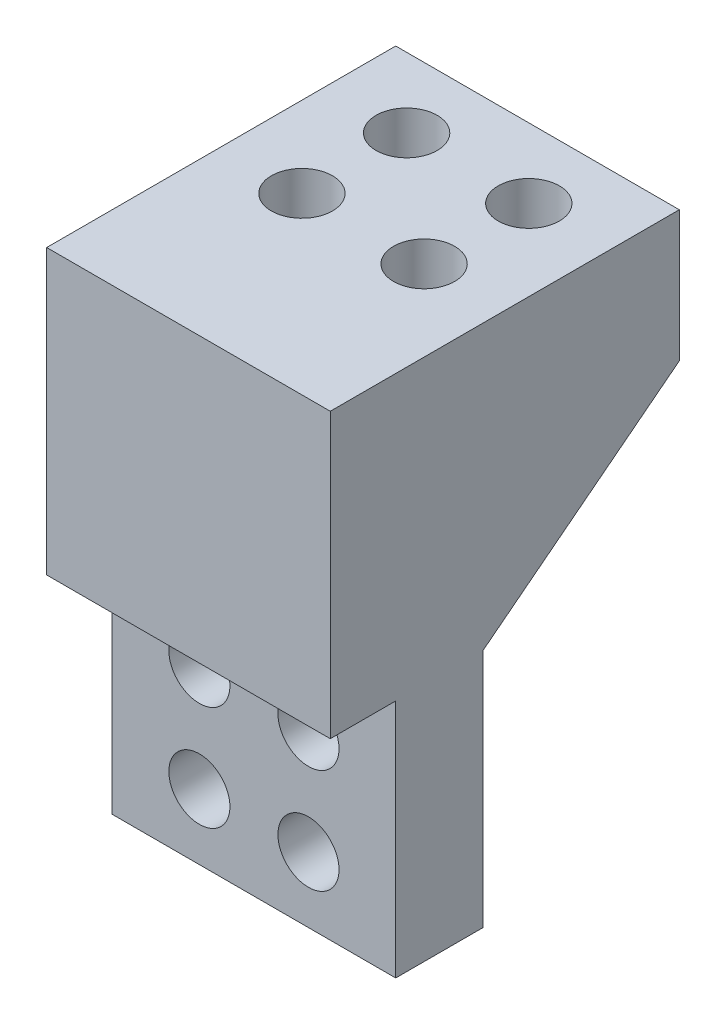
ISO-10303-21;
HEADER;
FILE_DESCRIPTION(('STEP AP214'),'2;1');
FILE_NAME('part.step','',(''),(''),'','','');
FILE_SCHEMA(('AUTOMOTIVE_DESIGN { 1 0 10303 214 1 1 1 1 }'));
ENDSEC;
DATA;
#1=APPLICATION_CONTEXT('core data for automotive mechanical design processes');
#2=APPLICATION_PROTOCOL_DEFINITION('international standard','automotive_design',2000,#1);
#3=PRODUCT_CONTEXT('',#1,'mechanical');
#4=PRODUCT('Part','Part','',(#3));
#5=PRODUCT_RELATED_PRODUCT_CATEGORY('part','',(#4));
#6=PRODUCT_DEFINITION_FORMATION('','',#4);
#7=PRODUCT_DEFINITION_CONTEXT('part definition',#1,'design');
#8=PRODUCT_DEFINITION('design','',#6,#7);
#9=PRODUCT_DEFINITION_SHAPE('','',#8);
#10=(LENGTH_UNIT() NAMED_UNIT(*) SI_UNIT(.MILLI.,.METRE.));
#11=(NAMED_UNIT(*) PLANE_ANGLE_UNIT() SI_UNIT($,.RADIAN.));
#12=(NAMED_UNIT(*) SI_UNIT($,.STERADIAN.) SOLID_ANGLE_UNIT());
#13=UNCERTAINTY_MEASURE_WITH_UNIT(LENGTH_MEASURE(1.E-05),#10,'distance_accuracy_value','');
#14=(GEOMETRIC_REPRESENTATION_CONTEXT(3) GLOBAL_UNCERTAINTY_ASSIGNED_CONTEXT((#13)) GLOBAL_UNIT_ASSIGNED_CONTEXT((#10,
#11,#12)) REPRESENTATION_CONTEXT('',''));
#15=CARTESIAN_POINT('',(0.,0.,0.));
#16=DIRECTION('',(0.,0.,1.));
#17=DIRECTION('',(1.,0.,0.));
#18=AXIS2_PLACEMENT_3D('',#15,#16,#17);
#19=CARTESIAN_POINT('',(32.5,-60.,80.));
#20=DIRECTION('',(-1.,0.,0.));
#21=DIRECTION('',(0.,0.,1.));
#22=AXIS2_PLACEMENT_3D('',#19,#20,#21);
#23=PLANE('',#22);
#24=DIRECTION('',(0.,-1.,0.));
#25=VECTOR('',#24,1.);
#26=CARTESIAN_POINT('',(32.5,-60.,45.));
#27=LINE('',#26,#25);
#28=CARTESIAN_POINT('',(32.5,-5.00000000000001,45.));
#29=VERTEX_POINT('',#28);
#30=CARTESIAN_POINT('',(32.5,-60.,45.));
#31=VERTEX_POINT('',#30);
#32=EDGE_CURVE('E99',#29,#31,#27,.T.);
#33=ORIENTED_EDGE('',*,*,#32,.F.);
#34=DIRECTION('',(0.,-0.61394061351492,0.789352217376326));
#35=VECTOR('',#34,1.);
#36=CARTESIAN_POINT('',(32.5,-5.00000000000001,45.));
#37=LINE('',#36,#35);
#38=CARTESIAN_POINT('',(32.5,30.,0.));
#39=VERTEX_POINT('',#38);
#40=EDGE_CURVE('E106',#39,#29,#37,.T.);
#41=ORIENTED_EDGE('',*,*,#40,.F.);
#42=DIRECTION('',(0.,1.,0.));
#43=VECTOR('',#42,1.);
#44=CARTESIAN_POINT('',(32.5,-60.,0.));
#45=LINE('',#44,#43);
#46=CARTESIAN_POINT('',(32.5,60.,0.));
#47=VERTEX_POINT('',#46);
#48=EDGE_CURVE('E136',#39,#47,#45,.T.);
#49=ORIENTED_EDGE('',*,*,#48,.T.);
#50=DIRECTION('',(0.,0.,-1.));
#51=VECTOR('',#50,1.);
#52=CARTESIAN_POINT('',(32.5,60.,80.));
#53=LINE('',#52,#51);
#54=CARTESIAN_POINT('',(32.5,60.,80.));
#55=VERTEX_POINT('',#54);
#56=EDGE_CURVE('E157',#55,#47,#53,.T.);
#57=ORIENTED_EDGE('',*,*,#56,.F.);
#58=DIRECTION('',(0.,1.,0.));
#59=VECTOR('',#58,1.);
#60=CARTESIAN_POINT('',(32.5,-60.,80.));
#61=LINE('',#60,#59);
#62=CARTESIAN_POINT('',(32.5,-5.00000000000001,80.));
#63=VERTEX_POINT('',#62);
#64=EDGE_CURVE('E137',#63,#55,#61,.T.);
#65=ORIENTED_EDGE('',*,*,#64,.F.);
#66=DIRECTION('',(0.,0.,1.));
#67=VECTOR('',#66,1.);
#68=CARTESIAN_POINT('',(32.5,-5.00000000000001,80.));
#69=LINE('',#68,#67);
#70=CARTESIAN_POINT('',(32.5,-5.00000000000001,65.));
#71=VERTEX_POINT('',#70);
#72=EDGE_CURVE('E54',#71,#63,#69,.T.);
#73=ORIENTED_EDGE('',*,*,#72,.F.);
#74=DIRECTION('',(0.,1.,0.));
#75=VECTOR('',#74,1.);
#76=CARTESIAN_POINT('',(32.5,-5.00000000000001,65.));
#77=LINE('',#76,#75);
#78=CARTESIAN_POINT('',(32.5,-60.,65.));
#79=VERTEX_POINT('',#78);
#80=EDGE_CURVE('E122',#79,#71,#77,.T.);
#81=ORIENTED_EDGE('',*,*,#80,.F.);
#82=DIRECTION('',(0.,0.,-1.));
#83=VECTOR('',#82,1.);
#84=CARTESIAN_POINT('',(32.5,-60.,80.));
#85=LINE('',#84,#83);
#86=EDGE_CURVE('E115',#79,#31,#85,.T.);
#87=ORIENTED_EDGE('',*,*,#86,.T.);
#88=EDGE_LOOP('',(#33,#41,#49,#57,#65,#73,#81,#87));
#89=FACE_BOUND('',#88,.T.);
#90=ADVANCED_FACE('F33',(#89),#23,.F.);
#91=CARTESIAN_POINT('',(-32.5,60.,80.));
#92=DIRECTION('',(0.,-1.,0.));
#93=DIRECTION('',(0.,0.,-1.));
#94=AXIS2_PLACEMENT_3D('',#91,#92,#93);
#95=PLANE('',#94);
#96=CARTESIAN_POINT('',(-14.,60.,16.));
#97=DIRECTION('',(0.,1.,0.));
#98=DIRECTION('',(0.,0.,1.));
#99=AXIS2_PLACEMENT_3D('',#96,#97,#98);
#100=CIRCLE('',#99,7.);
#101=CARTESIAN_POINT('',(-14.,60.,23.));
#102=VERTEX_POINT('',#101);
#103=EDGE_CURVE('E375',#102,#102,#100,.T.);
#104=ORIENTED_EDGE('',*,*,#103,.F.);
#105=EDGE_LOOP('',(#104));
#106=FACE_BOUND('',#105,.T.);
#107=CARTESIAN_POINT('',(14.,60.,40.));
#108=DIRECTION('',(0.,1.,0.));
#109=DIRECTION('',(0.,0.,1.));
#110=AXIS2_PLACEMENT_3D('',#107,#108,#109);
#111=CIRCLE('',#110,7.);
#112=CARTESIAN_POINT('',(14.,60.,47.));
#113=VERTEX_POINT('',#112);
#114=EDGE_CURVE('E386',#113,#113,#111,.T.);
#115=ORIENTED_EDGE('',*,*,#114,.F.);
#116=EDGE_LOOP('',(#115));
#117=FACE_BOUND('',#116,.T.);
#118=CARTESIAN_POINT('',(-14.,60.,40.));
#119=DIRECTION('',(0.,1.,0.));
#120=DIRECTION('',(0.,0.,1.));
#121=AXIS2_PLACEMENT_3D('',#118,#119,#120);
#122=CIRCLE('',#121,7.);
#123=CARTESIAN_POINT('',(-14.,60.,47.));
#124=VERTEX_POINT('',#123);
#125=EDGE_CURVE('E392',#124,#124,#122,.T.);
#126=ORIENTED_EDGE('',*,*,#125,.F.);
#127=EDGE_LOOP('',(#126));
#128=FACE_BOUND('',#127,.T.);
#129=CARTESIAN_POINT('',(14.,60.,16.));
#130=DIRECTION('',(0.,1.,0.));
#131=DIRECTION('',(0.,0.,1.));
#132=AXIS2_PLACEMENT_3D('',#129,#130,#131);
#133=CIRCLE('',#132,7.);
#134=CARTESIAN_POINT('',(14.,60.,23.));
#135=VERTEX_POINT('',#134);
#136=EDGE_CURVE('E374',#135,#135,#133,.T.);
#137=ORIENTED_EDGE('',*,*,#136,.F.);
#138=EDGE_LOOP('',(#137));
#139=FACE_BOUND('',#138,.T.);
#140=DIRECTION('',(-1.,0.,0.));
#141=VECTOR('',#140,1.);
#142=CARTESIAN_POINT('',(-32.5,60.,0.));
#143=LINE('',#142,#141);
#144=CARTESIAN_POINT('',(-32.5,60.,0.));
#145=VERTEX_POINT('',#144);
#146=EDGE_CURVE('E146',#47,#145,#143,.T.);
#147=ORIENTED_EDGE('',*,*,#146,.T.);
#148=DIRECTION('',(0.,0.,-1.));
#149=VECTOR('',#148,1.);
#150=CARTESIAN_POINT('',(-32.5,60.,80.));
#151=LINE('',#150,#149);
#152=CARTESIAN_POINT('',(-32.5,60.,80.));
#153=VERTEX_POINT('',#152);
#154=EDGE_CURVE('E154',#153,#145,#151,.T.);
#155=ORIENTED_EDGE('',*,*,#154,.F.);
#156=DIRECTION('',(-1.,0.,0.));
#157=VECTOR('',#156,1.);
#158=CARTESIAN_POINT('',(-32.5,60.,80.));
#159=LINE('',#158,#157);
#160=EDGE_CURVE('E139',#55,#153,#159,.T.);
#161=ORIENTED_EDGE('',*,*,#160,.F.);
#162=ORIENTED_EDGE('',*,*,#56,.T.);
#163=EDGE_LOOP('',(#147,#155,#161,#162));
#164=FACE_BOUND('',#163,.T.);
#165=ADVANCED_FACE('F167',(#106,#117,#128,#139,#164),#95,.F.);
#166=CARTESIAN_POINT('',(-32.5,-60.,80.));
#167=DIRECTION('',(1.,0.,0.));
#168=DIRECTION('',(0.,0.,-1.));
#169=AXIS2_PLACEMENT_3D('',#166,#167,#168);
#170=PLANE('',#169);
#171=DIRECTION('',(0.,-1.,0.));
#172=VECTOR('',#171,1.);
#173=CARTESIAN_POINT('',(-32.5,-60.,0.));
#174=LINE('',#173,#172);
#175=CARTESIAN_POINT('',(-32.5,30.,0.));
#176=VERTEX_POINT('',#175);
#177=EDGE_CURVE('E140',#145,#176,#174,.T.);
#178=ORIENTED_EDGE('',*,*,#177,.T.);
#179=DIRECTION('',(0.,-0.613940613514921,0.789352217376326));
#180=VECTOR('',#179,1.);
#181=CARTESIAN_POINT('',(-32.5,-42.6923076923077,93.4615384615385));
#182=LINE('',#181,#180);
#183=CARTESIAN_POINT('',(-32.5,-5.00000000000001,45.));
#184=VERTEX_POINT('',#183);
#185=EDGE_CURVE('E46',#176,#184,#182,.T.);
#186=ORIENTED_EDGE('',*,*,#185,.T.);
#187=DIRECTION('',(0.,-1.,0.));
#188=VECTOR('',#187,1.);
#189=CARTESIAN_POINT('',(-32.5,-60.,45.));
#190=LINE('',#189,#188);
#191=CARTESIAN_POINT('',(-32.5,-60.,45.));
#192=VERTEX_POINT('',#191);
#193=EDGE_CURVE('E102',#184,#192,#190,.T.);
#194=ORIENTED_EDGE('',*,*,#193,.T.);
#195=DIRECTION('',(0.,0.,-1.));
#196=VECTOR('',#195,1.);
#197=CARTESIAN_POINT('',(-32.5,-60.,80.));
#198=LINE('',#197,#196);
#199=CARTESIAN_POINT('',(-32.5,-60.,65.));
#200=VERTEX_POINT('',#199);
#201=EDGE_CURVE('E151',#200,#192,#198,.T.);
#202=ORIENTED_EDGE('',*,*,#201,.F.);
#203=DIRECTION('',(0.,1.,0.));
#204=VECTOR('',#203,1.);
#205=CARTESIAN_POINT('',(-32.5,-60.,65.));
#206=LINE('',#205,#204);
#207=CARTESIAN_POINT('',(-32.5,-5.00000000000001,65.));
#208=VERTEX_POINT('',#207);
#209=EDGE_CURVE('E133',#200,#208,#206,.T.);
#210=ORIENTED_EDGE('',*,*,#209,.T.);
#211=DIRECTION('',(0.,0.,1.));
#212=VECTOR('',#211,1.);
#213=CARTESIAN_POINT('',(-32.5,-5.00000000000001,80.));
#214=LINE('',#213,#212);
#215=CARTESIAN_POINT('',(-32.5,-5.00000000000001,80.));
#216=VERTEX_POINT('',#215);
#217=EDGE_CURVE('E129',#208,#216,#214,.T.);
#218=ORIENTED_EDGE('',*,*,#217,.T.);
#219=DIRECTION('',(0.,-1.,0.));
#220=VECTOR('',#219,1.);
#221=CARTESIAN_POINT('',(-32.5,-60.,80.));
#222=LINE('',#221,#220);
#223=EDGE_CURVE('E142',#153,#216,#222,.T.);
#224=ORIENTED_EDGE('',*,*,#223,.F.);
#225=ORIENTED_EDGE('',*,*,#154,.T.);
#226=EDGE_LOOP('',(#178,#186,#194,#202,#210,#218,#224,#225));
#227=FACE_BOUND('',#226,.T.);
#228=ADVANCED_FACE('F171',(#227),#170,.F.);
#229=CARTESIAN_POINT('',(-32.5,-60.,80.));
#230=DIRECTION('',(0.,1.,0.));
#231=DIRECTION('',(0.,0.,1.));
#232=AXIS2_PLACEMENT_3D('',#229,#230,#231);
#233=PLANE('',#232);
#234=ORIENTED_EDGE('',*,*,#201,.T.);
#235=DIRECTION('',(1.,0.,0.));
#236=VECTOR('',#235,1.);
#237=CARTESIAN_POINT('',(-47.5,-60.,45.));
#238=LINE('',#237,#236);
#239=EDGE_CURVE('E103',#192,#31,#238,.T.);
#240=ORIENTED_EDGE('',*,*,#239,.T.);
#241=ORIENTED_EDGE('',*,*,#86,.F.);
#242=DIRECTION('',(1.,0.,0.));
#243=VECTOR('',#242,1.);
#244=CARTESIAN_POINT('',(-47.5,-60.,65.));
#245=LINE('',#244,#243);
#246=EDGE_CURVE('E126',#200,#79,#245,.T.);
#247=ORIENTED_EDGE('',*,*,#246,.F.);
#248=EDGE_LOOP('',(#234,#240,#241,#247));
#249=FACE_BOUND('',#248,.T.);
#250=ADVANCED_FACE('F179',(#249),#233,.F.);
#251=CARTESIAN_POINT('',(0.,0.,80.));
#252=DIRECTION('',(0.,0.,-1.));
#253=DIRECTION('',(-1.,0.,0.));
#254=AXIS2_PLACEMENT_3D('',#251,#252,#253);
#255=PLANE('',#254);
#256=ORIENTED_EDGE('',*,*,#223,.T.);
#257=DIRECTION('',(1.,0.,0.));
#258=VECTOR('',#257,1.);
#259=CARTESIAN_POINT('',(0.,-5.00000000000001,80.));
#260=LINE('',#259,#258);
#261=EDGE_CURVE('E40',#216,#63,#260,.T.);
#262=ORIENTED_EDGE('',*,*,#261,.T.);
#263=ORIENTED_EDGE('',*,*,#64,.T.);
#264=ORIENTED_EDGE('',*,*,#160,.T.);
#265=EDGE_LOOP('',(#256,#262,#263,#264));
#266=FACE_BOUND('',#265,.T.);
#267=ADVANCED_FACE('F161',(#266),#255,.F.);
#268=CARTESIAN_POINT('',(0.,0.,0.));
#269=DIRECTION('',(0.,0.,-1.));
#270=DIRECTION('',(-1.,0.,0.));
#271=AXIS2_PLACEMENT_3D('',#268,#269,#270);
#272=PLANE('',#271);
#273=DIRECTION('',(1.,0.,0.));
#274=VECTOR('',#273,1.);
#275=CARTESIAN_POINT('',(0.,30.,0.));
#276=LINE('',#275,#274);
#277=EDGE_CURVE('E11',#176,#39,#276,.T.);
#278=ORIENTED_EDGE('',*,*,#277,.F.);
#279=ORIENTED_EDGE('',*,*,#177,.F.);
#280=ORIENTED_EDGE('',*,*,#146,.F.);
#281=ORIENTED_EDGE('',*,*,#48,.F.);
#282=EDGE_LOOP('',(#278,#279,#280,#281));
#283=FACE_BOUND('',#282,.T.);
#284=ADVANCED_FACE('F181',(#283),#272,.T.);
#285=CARTESIAN_POINT('',(-47.5,-5.00000000000001,65.));
#286=DIRECTION('',(0.,0.,-1.));
#287=DIRECTION('',(-1.,0.,0.));
#288=AXIS2_PLACEMENT_3D('',#285,#286,#287);
#289=PLANE('',#288);
#290=CARTESIAN_POINT('',(-12.5,-45.,65.));
#291=DIRECTION('',(0.,0.,1.));
#292=DIRECTION('',(1.,0.,0.));
#293=AXIS2_PLACEMENT_3D('',#290,#291,#292);
#294=CIRCLE('',#293,7.);
#295=CARTESIAN_POINT('',(-5.5,-45.,65.));
#296=VERTEX_POINT('',#295);
#297=EDGE_CURVE('E398',#296,#296,#294,.T.);
#298=ORIENTED_EDGE('',*,*,#297,.F.);
#299=EDGE_LOOP('',(#298));
#300=FACE_BOUND('',#299,.T.);
#301=CARTESIAN_POINT('',(12.5,-21.,65.));
#302=DIRECTION('',(0.,0.,1.));
#303=DIRECTION('',(1.,0.,0.));
#304=AXIS2_PLACEMENT_3D('',#301,#302,#303);
#305=CIRCLE('',#304,7.);
#306=CARTESIAN_POINT('',(19.5,-21.,65.));
#307=VERTEX_POINT('',#306);
#308=EDGE_CURVE('E406',#307,#307,#305,.T.);
#309=ORIENTED_EDGE('',*,*,#308,.F.);
#310=EDGE_LOOP('',(#309));
#311=FACE_BOUND('',#310,.T.);
#312=CARTESIAN_POINT('',(12.5,-45.,65.));
#313=DIRECTION('',(0.,0.,1.));
#314=DIRECTION('',(1.,0.,0.));
#315=AXIS2_PLACEMENT_3D('',#312,#313,#314);
#316=CIRCLE('',#315,7.);
#317=CARTESIAN_POINT('',(19.5,-45.,65.));
#318=VERTEX_POINT('',#317);
#319=EDGE_CURVE('E396',#318,#318,#316,.T.);
#320=ORIENTED_EDGE('',*,*,#319,.F.);
#321=EDGE_LOOP('',(#320));
#322=FACE_BOUND('',#321,.T.);
#323=CARTESIAN_POINT('',(-12.5,-21.,65.));
#324=DIRECTION('',(0.,0.,1.));
#325=DIRECTION('',(1.,0.,0.));
#326=AXIS2_PLACEMENT_3D('',#323,#324,#325);
#327=CIRCLE('',#326,7.);
#328=CARTESIAN_POINT('',(-5.5,-21.,65.));
#329=VERTEX_POINT('',#328);
#330=EDGE_CURVE('E405',#329,#329,#327,.T.);
#331=ORIENTED_EDGE('',*,*,#330,.F.);
#332=EDGE_LOOP('',(#331));
#333=FACE_BOUND('',#332,.T.);
#334=ORIENTED_EDGE('',*,*,#246,.T.);
#335=ORIENTED_EDGE('',*,*,#80,.T.);
#336=DIRECTION('',(1.,0.,0.));
#337=VECTOR('',#336,1.);
#338=CARTESIAN_POINT('',(-47.5,-5.00000000000001,65.));
#339=LINE('',#338,#337);
#340=EDGE_CURVE('E127',#208,#71,#339,.T.);
#341=ORIENTED_EDGE('',*,*,#340,.F.);
#342=ORIENTED_EDGE('',*,*,#209,.F.);
#343=EDGE_LOOP('',(#334,#335,#341,#342));
#344=FACE_BOUND('',#343,.T.);
#345=ADVANCED_FACE('F176',(#300,#311,#322,#333,#344),#289,.F.);
#346=CARTESIAN_POINT('',(-47.5,-5.00000000000001,80.));
#347=DIRECTION('',(0.,1.,0.));
#348=DIRECTION('',(0.,0.,1.));
#349=AXIS2_PLACEMENT_3D('',#346,#347,#348);
#350=PLANE('',#349);
#351=ORIENTED_EDGE('',*,*,#340,.T.);
#352=ORIENTED_EDGE('',*,*,#72,.T.);
#353=ORIENTED_EDGE('',*,*,#261,.F.);
#354=ORIENTED_EDGE('',*,*,#217,.F.);
#355=EDGE_LOOP('',(#351,#352,#353,#354));
#356=FACE_BOUND('',#355,.T.);
#357=ADVANCED_FACE('F174',(#356),#350,.F.);
#358=CARTESIAN_POINT('',(-47.5,-60.,45.));
#359=DIRECTION('',(0.,0.,1.));
#360=DIRECTION('',(1.,0.,0.));
#361=AXIS2_PLACEMENT_3D('',#358,#359,#360);
#362=PLANE('',#361);
#363=CARTESIAN_POINT('',(-12.5,-45.,45.));
#364=DIRECTION('',(0.,0.,1.));
#365=DIRECTION('',(1.,0.,0.));
#366=AXIS2_PLACEMENT_3D('',#363,#364,#365);
#367=CIRCLE('',#366,7.);
#368=CARTESIAN_POINT('',(-5.5,-45.,45.));
#369=VERTEX_POINT('',#368);
#370=EDGE_CURVE('E401',#369,#369,#367,.F.);
#371=ORIENTED_EDGE('',*,*,#370,.F.);
#372=EDGE_LOOP('',(#371));
#373=FACE_BOUND('',#372,.T.);
#374=CARTESIAN_POINT('',(12.5,-21.,45.));
#375=DIRECTION('',(0.,0.,1.));
#376=DIRECTION('',(1.,0.,0.));
#377=AXIS2_PLACEMENT_3D('',#374,#375,#376);
#378=CIRCLE('',#377,7.);
#379=CARTESIAN_POINT('',(19.5,-21.,45.));
#380=VERTEX_POINT('',#379);
#381=EDGE_CURVE('E402',#380,#380,#378,.F.);
#382=ORIENTED_EDGE('',*,*,#381,.F.);
#383=EDGE_LOOP('',(#382));
#384=FACE_BOUND('',#383,.T.);
#385=CARTESIAN_POINT('',(12.5,-45.,45.));
#386=DIRECTION('',(0.,0.,1.));
#387=DIRECTION('',(1.,0.,0.));
#388=AXIS2_PLACEMENT_3D('',#385,#386,#387);
#389=CIRCLE('',#388,7.);
#390=CARTESIAN_POINT('',(19.5,-45.,45.));
#391=VERTEX_POINT('',#390);
#392=EDGE_CURVE('E409',#391,#391,#389,.F.);
#393=ORIENTED_EDGE('',*,*,#392,.F.);
#394=EDGE_LOOP('',(#393));
#395=FACE_BOUND('',#394,.T.);
#396=CARTESIAN_POINT('',(-12.5,-21.,45.));
#397=DIRECTION('',(0.,0.,1.));
#398=DIRECTION('',(1.,0.,0.));
#399=AXIS2_PLACEMENT_3D('',#396,#397,#398);
#400=CIRCLE('',#399,7.);
#401=CARTESIAN_POINT('',(-5.5,-21.,45.));
#402=VERTEX_POINT('',#401);
#403=EDGE_CURVE('E110',#402,#402,#400,.F.);
#404=ORIENTED_EDGE('',*,*,#403,.F.);
#405=EDGE_LOOP('',(#404));
#406=FACE_BOUND('',#405,.T.);
#407=DIRECTION('',(1.,0.,0.));
#408=VECTOR('',#407,1.);
#409=CARTESIAN_POINT('',(-47.5,-5.00000000000001,45.));
#410=LINE('',#409,#408);
#411=EDGE_CURVE('E95',#184,#29,#410,.T.);
#412=ORIENTED_EDGE('',*,*,#411,.T.);
#413=ORIENTED_EDGE('',*,*,#32,.T.);
#414=ORIENTED_EDGE('',*,*,#239,.F.);
#415=ORIENTED_EDGE('',*,*,#193,.F.);
#416=EDGE_LOOP('',(#412,#413,#414,#415));
#417=FACE_BOUND('',#416,.T.);
#418=ADVANCED_FACE('F97',(#373,#384,#395,#406,#417),#362,.F.);
#419=CARTESIAN_POINT('',(-47.5,-5.00000000000001,45.));
#420=DIRECTION('',(0.,0.789352217376326,0.61394061351492));
#421=DIRECTION('',(0.,-0.613940613514921,0.789352217376326));
#422=AXIS2_PLACEMENT_3D('',#419,#420,#421);
#423=PLANE('',#422);
#424=ORIENTED_EDGE('',*,*,#277,.T.);
#425=ORIENTED_EDGE('',*,*,#40,.T.);
#426=ORIENTED_EDGE('',*,*,#411,.F.);
#427=ORIENTED_EDGE('',*,*,#185,.F.);
#428=EDGE_LOOP('',(#424,#425,#426,#427));
#429=FACE_BOUND('',#428,.T.);
#430=ADVANCED_FACE('F107',(#429),#423,.F.);
#431=CARTESIAN_POINT('',(-12.5,-21.,25.2010101267767));
#432=DIRECTION('',(0.,0.,1.));
#433=DIRECTION('',(1.,0.,0.));
#434=AXIS2_PLACEMENT_3D('',#431,#432,#433);
#435=CYLINDRICAL_SURFACE('',#434,7.);
#436=ORIENTED_EDGE('',*,*,#403,.T.);
#437=EDGE_LOOP('',(#436));
#438=FACE_BOUND('',#437,.T.);
#439=ORIENTED_EDGE('',*,*,#330,.T.);
#440=EDGE_LOOP('',(#439));
#441=FACE_BOUND('',#440,.T.);
#442=ADVANCED_FACE('F238',(#438,#441),#435,.F.);
#443=CARTESIAN_POINT('',(12.5,-45.,25.2010101267767));
#444=DIRECTION('',(0.,0.,1.));
#445=DIRECTION('',(1.,0.,0.));
#446=AXIS2_PLACEMENT_3D('',#443,#444,#445);
#447=CYLINDRICAL_SURFACE('',#446,7.);
#448=ORIENTED_EDGE('',*,*,#392,.T.);
#449=EDGE_LOOP('',(#448));
#450=FACE_BOUND('',#449,.T.);
#451=ORIENTED_EDGE('',*,*,#319,.T.);
#452=EDGE_LOOP('',(#451));
#453=FACE_BOUND('',#452,.T.);
#454=ADVANCED_FACE('F259',(#450,#453),#447,.F.);
#455=CARTESIAN_POINT('',(12.5,-21.,25.2010101267767));
#456=DIRECTION('',(0.,0.,1.));
#457=DIRECTION('',(1.,0.,0.));
#458=AXIS2_PLACEMENT_3D('',#455,#456,#457);
#459=CYLINDRICAL_SURFACE('',#458,7.);
#460=ORIENTED_EDGE('',*,*,#381,.T.);
#461=EDGE_LOOP('',(#460));
#462=FACE_BOUND('',#461,.T.);
#463=ORIENTED_EDGE('',*,*,#308,.T.);
#464=EDGE_LOOP('',(#463));
#465=FACE_BOUND('',#464,.T.);
#466=ADVANCED_FACE('F269',(#462,#465),#459,.F.);
#467=CARTESIAN_POINT('',(-12.5,-45.,25.2010101267767));
#468=DIRECTION('',(0.,0.,1.));
#469=DIRECTION('',(1.,0.,0.));
#470=AXIS2_PLACEMENT_3D('',#467,#468,#469);
#471=CYLINDRICAL_SURFACE('',#470,7.);
#472=ORIENTED_EDGE('',*,*,#370,.T.);
#473=EDGE_LOOP('',(#472));
#474=FACE_BOUND('',#473,.T.);
#475=ORIENTED_EDGE('',*,*,#297,.T.);
#476=EDGE_LOOP('',(#475));
#477=FACE_BOUND('',#476,.T.);
#478=ADVANCED_FACE('F278',(#474,#477),#471,.F.);
#479=CARTESIAN_POINT('',(14.,50.,16.));
#480=DIRECTION('',(0.,1.,0.));
#481=DIRECTION('',(0.,0.,1.));
#482=AXIS2_PLACEMENT_3D('',#479,#480,#481);
#483=CYLINDRICAL_SURFACE('',#482,7.);
#484=CARTESIAN_POINT('',(14.,50.,16.));
#485=DIRECTION('',(0.,1.,0.));
#486=DIRECTION('',(0.,0.,1.));
#487=AXIS2_PLACEMENT_3D('',#484,#485,#486);
#488=CIRCLE('',#487,7.);
#489=CARTESIAN_POINT('',(14.,50.,23.));
#490=VERTEX_POINT('',#489);
#491=EDGE_CURVE('E378',#490,#490,#488,.T.);
#492=ORIENTED_EDGE('',*,*,#491,.F.);
#493=EDGE_LOOP('',(#492));
#494=FACE_BOUND('',#493,.T.);
#495=ORIENTED_EDGE('',*,*,#136,.T.);
#496=EDGE_LOOP('',(#495));
#497=FACE_BOUND('',#496,.T.);
#498=ADVANCED_FACE('F287',(#494,#497),#483,.F.);
#499=CARTESIAN_POINT('',(14.,50.,16.));
#500=DIRECTION('',(0.,1.,0.));
#501=DIRECTION('',(0.,0.,1.));
#502=AXIS2_PLACEMENT_3D('',#499,#500,#501);
#503=PLANE('',#502);
#504=ORIENTED_EDGE('',*,*,#491,.T.);
#505=EDGE_LOOP('',(#504));
#506=FACE_BOUND('',#505,.T.);
#507=ADVANCED_FACE('F297',(#506),#503,.T.);
#508=CARTESIAN_POINT('',(-14.,50.,40.));
#509=DIRECTION('',(0.,1.,0.));
#510=DIRECTION('',(0.,0.,1.));
#511=AXIS2_PLACEMENT_3D('',#508,#509,#510);
#512=CYLINDRICAL_SURFACE('',#511,7.);
#513=CARTESIAN_POINT('',(-14.,50.,40.));
#514=DIRECTION('',(0.,1.,0.));
#515=DIRECTION('',(0.,0.,1.));
#516=AXIS2_PLACEMENT_3D('',#513,#514,#515);
#517=CIRCLE('',#516,7.);
#518=CARTESIAN_POINT('',(-14.,50.,47.));
#519=VERTEX_POINT('',#518);
#520=EDGE_CURVE('E389',#519,#519,#517,.T.);
#521=ORIENTED_EDGE('',*,*,#520,.F.);
#522=EDGE_LOOP('',(#521));
#523=FACE_BOUND('',#522,.T.);
#524=ORIENTED_EDGE('',*,*,#125,.T.);
#525=EDGE_LOOP('',(#524));
#526=FACE_BOUND('',#525,.T.);
#527=ADVANCED_FACE('F304',(#523,#526),#512,.F.);
#528=CARTESIAN_POINT('',(-14.,50.,40.));
#529=DIRECTION('',(0.,1.,0.));
#530=DIRECTION('',(0.,0.,1.));
#531=AXIS2_PLACEMENT_3D('',#528,#529,#530);
#532=PLANE('',#531);
#533=ORIENTED_EDGE('',*,*,#520,.T.);
#534=EDGE_LOOP('',(#533));
#535=FACE_BOUND('',#534,.T.);
#536=ADVANCED_FACE('F312',(#535),#532,.T.);
#537=CARTESIAN_POINT('',(14.,50.,40.));
#538=DIRECTION('',(0.,1.,0.));
#539=DIRECTION('',(0.,0.,1.));
#540=AXIS2_PLACEMENT_3D('',#537,#538,#539);
#541=CYLINDRICAL_SURFACE('',#540,7.);
#542=CARTESIAN_POINT('',(14.,50.,40.));
#543=DIRECTION('',(0.,1.,0.));
#544=DIRECTION('',(0.,0.,1.));
#545=AXIS2_PLACEMENT_3D('',#542,#543,#544);
#546=CIRCLE('',#545,7.);
#547=CARTESIAN_POINT('',(14.,50.,47.));
#548=VERTEX_POINT('',#547);
#549=EDGE_CURVE('E381',#548,#548,#546,.T.);
#550=ORIENTED_EDGE('',*,*,#549,.F.);
#551=EDGE_LOOP('',(#550));
#552=FACE_BOUND('',#551,.T.);
#553=ORIENTED_EDGE('',*,*,#114,.T.);
#554=EDGE_LOOP('',(#553));
#555=FACE_BOUND('',#554,.T.);
#556=ADVANCED_FACE('F320',(#552,#555),#541,.F.);
#557=CARTESIAN_POINT('',(14.,50.,40.));
#558=DIRECTION('',(0.,1.,0.));
#559=DIRECTION('',(0.,0.,1.));
#560=AXIS2_PLACEMENT_3D('',#557,#558,#559);
#561=PLANE('',#560);
#562=ORIENTED_EDGE('',*,*,#549,.T.);
#563=EDGE_LOOP('',(#562));
#564=FACE_BOUND('',#563,.T.);
#565=ADVANCED_FACE('F328',(#564),#561,.T.);
#566=CARTESIAN_POINT('',(-14.,50.,16.));
#567=DIRECTION('',(0.,1.,0.));
#568=DIRECTION('',(0.,0.,1.));
#569=AXIS2_PLACEMENT_3D('',#566,#567,#568);
#570=CYLINDRICAL_SURFACE('',#569,7.);
#571=CARTESIAN_POINT('',(-14.,50.,16.));
#572=DIRECTION('',(0.,1.,0.));
#573=DIRECTION('',(0.,0.,1.));
#574=AXIS2_PLACEMENT_3D('',#571,#572,#573);
#575=CIRCLE('',#574,7.);
#576=CARTESIAN_POINT('',(-14.,50.,23.));
#577=VERTEX_POINT('',#576);
#578=EDGE_CURVE('E373',#577,#577,#575,.T.);
#579=ORIENTED_EDGE('',*,*,#578,.F.);
#580=EDGE_LOOP('',(#579));
#581=FACE_BOUND('',#580,.T.);
#582=ORIENTED_EDGE('',*,*,#103,.T.);
#583=EDGE_LOOP('',(#582));
#584=FACE_BOUND('',#583,.T.);
#585=ADVANCED_FACE('F336',(#581,#584),#570,.F.);
#586=CARTESIAN_POINT('',(-14.,50.,16.));
#587=DIRECTION('',(0.,1.,0.));
#588=DIRECTION('',(0.,0.,1.));
#589=AXIS2_PLACEMENT_3D('',#586,#587,#588);
#590=PLANE('',#589);
#591=ORIENTED_EDGE('',*,*,#578,.T.);
#592=EDGE_LOOP('',(#591));
#593=FACE_BOUND('',#592,.T.);
#594=ADVANCED_FACE('F344',(#593),#590,.T.);
#595=CLOSED_SHELL('',(#90,#165,#228,#250,#267,#284,#345,#357,#418,#430,#442,#454,#466,#478,#498,
#507,#527,#536,#556,#565,#585,#594));
#596=MANIFOLD_SOLID_BREP('B2',#595);
#597=ADVANCED_BREP_SHAPE_REPRESENTATION('',(#18,#596),#14);
#598=SHAPE_DEFINITION_REPRESENTATION(#9,#597);
ENDSEC;
END-ISO-10303-21;
